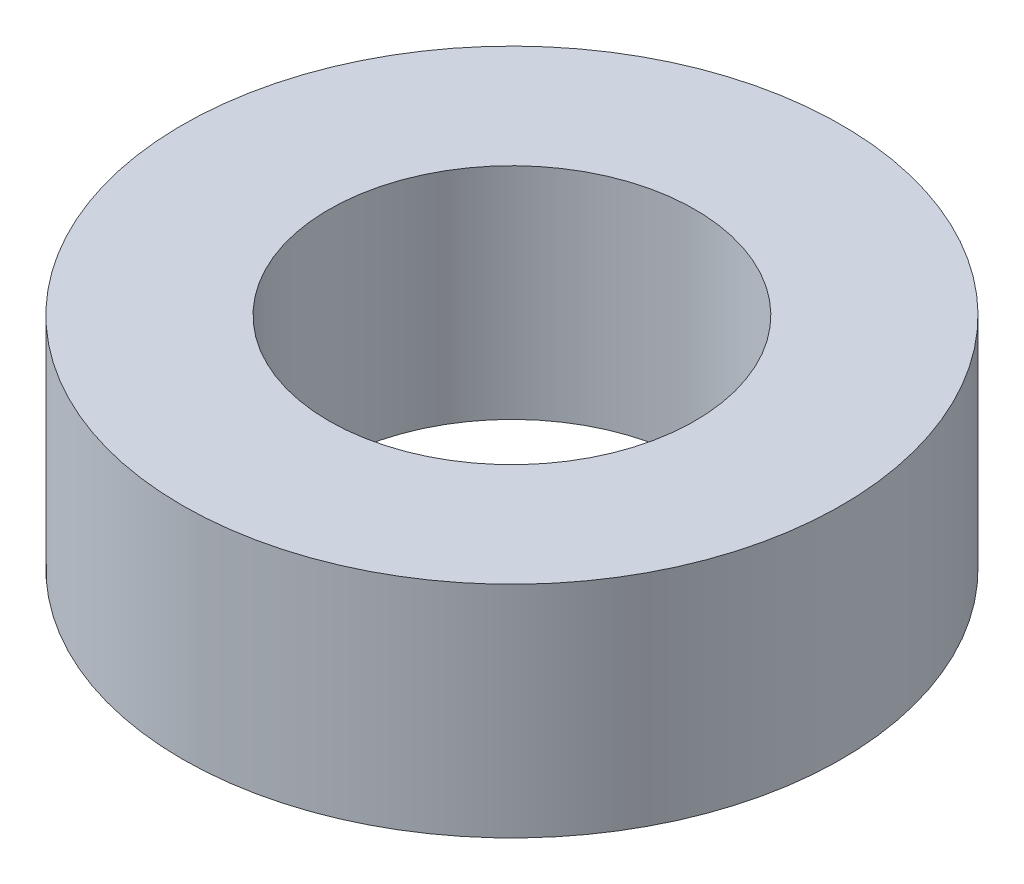
ISO-10303-21;
HEADER;
FILE_DESCRIPTION(('STEP AP214'),'2;1');
FILE_NAME('part.step','',(''),(''),'','','');
FILE_SCHEMA(('AUTOMOTIVE_DESIGN { 1 0 10303 214 1 1 1 1 }'));
ENDSEC;
DATA;
#1=APPLICATION_CONTEXT('core data for automotive mechanical design processes');
#2=APPLICATION_PROTOCOL_DEFINITION('international standard','automotive_design',2000,#1);
#3=PRODUCT_CONTEXT('',#1,'mechanical');
#4=PRODUCT('Part','Part','',(#3));
#5=PRODUCT_RELATED_PRODUCT_CATEGORY('part','',(#4));
#6=PRODUCT_DEFINITION_FORMATION('','',#4);
#7=PRODUCT_DEFINITION_CONTEXT('part definition',#1,'design');
#8=PRODUCT_DEFINITION('design','',#6,#7);
#9=PRODUCT_DEFINITION_SHAPE('','',#8);
#10=(LENGTH_UNIT() NAMED_UNIT(*) SI_UNIT(.MILLI.,.METRE.));
#11=(NAMED_UNIT(*) PLANE_ANGLE_UNIT() SI_UNIT($,.RADIAN.));
#12=(NAMED_UNIT(*) SI_UNIT($,.STERADIAN.) SOLID_ANGLE_UNIT());
#13=UNCERTAINTY_MEASURE_WITH_UNIT(LENGTH_MEASURE(1.E-05),#10,'distance_accuracy_value','');
#14=(GEOMETRIC_REPRESENTATION_CONTEXT(3) GLOBAL_UNCERTAINTY_ASSIGNED_CONTEXT((#13)) GLOBAL_UNIT_ASSIGNED_CONTEXT((#10,
#11,#12)) REPRESENTATION_CONTEXT('',''));
#15=CARTESIAN_POINT('',(0.,0.,0.));
#16=DIRECTION('',(0.,0.,1.));
#17=DIRECTION('',(1.,0.,0.));
#18=AXIS2_PLACEMENT_3D('',#15,#16,#17);
#19=CARTESIAN_POINT('',(0.,30.,0.));
#20=DIRECTION('',(0.,-1.,0.));
#21=DIRECTION('',(0.,0.,-1.));
#22=AXIS2_PLACEMENT_3D('',#19,#20,#21);
#23=CYLINDRICAL_SURFACE('',#22,45.);
#24=CARTESIAN_POINT('',(0.,30.,0.));
#25=DIRECTION('',(0.,1.,0.));
#26=DIRECTION('',(0.,0.,1.));
#27=AXIS2_PLACEMENT_3D('',#24,#25,#26);
#28=CIRCLE('',#27,45.);
#29=CARTESIAN_POINT('',(0.,30.,45.));
#30=VERTEX_POINT('',#29);
#31=EDGE_CURVE('E10',#30,#30,#28,.T.);
#32=ORIENTED_EDGE('',*,*,#31,.F.);
#33=EDGE_LOOP('',(#32));
#34=FACE_BOUND('',#33,.T.);
#35=CARTESIAN_POINT('',(0.,0.,0.));
#36=DIRECTION('',(0.,1.,0.));
#37=DIRECTION('',(0.,0.,1.));
#38=AXIS2_PLACEMENT_3D('',#35,#36,#37);
#39=CIRCLE('',#38,45.);
#40=CARTESIAN_POINT('',(0.,0.,45.));
#41=VERTEX_POINT('',#40);
#42=EDGE_CURVE('E37',#41,#41,#39,.T.);
#43=ORIENTED_EDGE('',*,*,#42,.T.);
#44=EDGE_LOOP('',(#43));
#45=FACE_BOUND('',#44,.T.);
#46=ADVANCED_FACE('F40',(#34,#45),#23,.T.);
#47=CARTESIAN_POINT('',(0.,30.,0.));
#48=DIRECTION('',(0.,1.,0.));
#49=DIRECTION('',(0.,0.,1.));
#50=AXIS2_PLACEMENT_3D('',#47,#48,#49);
#51=PLANE('',#50);
#52=CARTESIAN_POINT('',(0.,30.,0.));
#53=DIRECTION('',(0.,1.,0.));
#54=DIRECTION('',(0.,0.,1.));
#55=AXIS2_PLACEMENT_3D('',#52,#53,#54);
#56=CIRCLE('',#55,25.);
#57=CARTESIAN_POINT('',(0.,30.,25.));
#58=VERTEX_POINT('',#57);
#59=EDGE_CURVE('E50',#58,#58,#56,.T.);
#60=ORIENTED_EDGE('',*,*,#59,.F.);
#61=EDGE_LOOP('',(#60));
#62=FACE_BOUND('',#61,.T.);
#63=ORIENTED_EDGE('',*,*,#31,.T.);
#64=EDGE_LOOP('',(#63));
#65=FACE_BOUND('',#64,.T.);
#66=ADVANCED_FACE('F59',(#62,#65),#51,.T.);
#67=CARTESIAN_POINT('',(0.,0.,0.));
#68=DIRECTION('',(0.,1.,0.));
#69=DIRECTION('',(0.,0.,1.));
#70=AXIS2_PLACEMENT_3D('',#67,#68,#69);
#71=PLANE('',#70);
#72=CARTESIAN_POINT('',(0.,0.,0.));
#73=DIRECTION('',(0.,1.,0.));
#74=DIRECTION('',(0.,0.,1.));
#75=AXIS2_PLACEMENT_3D('',#72,#73,#74);
#76=CIRCLE('',#75,25.);
#77=CARTESIAN_POINT('',(0.,0.,25.));
#78=VERTEX_POINT('',#77);
#79=EDGE_CURVE('E47',#78,#78,#76,.T.);
#80=ORIENTED_EDGE('',*,*,#79,.T.);
#81=EDGE_LOOP('',(#80));
#82=FACE_BOUND('',#81,.T.);
#83=ORIENTED_EDGE('',*,*,#42,.F.);
#84=EDGE_LOOP('',(#83));
#85=FACE_BOUND('',#84,.T.);
#86=ADVANCED_FACE('F58',(#82,#85),#71,.F.);
#87=CARTESIAN_POINT('',(0.,30.,0.));
#88=DIRECTION('',(0.,-1.,0.));
#89=DIRECTION('',(0.,0.,-1.));
#90=AXIS2_PLACEMENT_3D('',#87,#88,#89);
#91=CYLINDRICAL_SURFACE('',#90,25.);
#92=ORIENTED_EDGE('',*,*,#59,.T.);
#93=EDGE_LOOP('',(#92));
#94=FACE_BOUND('',#93,.T.);
#95=ORIENTED_EDGE('',*,*,#79,.F.);
#96=EDGE_LOOP('',(#95));
#97=FACE_BOUND('',#96,.T.);
#98=ADVANCED_FACE('F54',(#94,#97),#91,.F.);
#99=CLOSED_SHELL('',(#46,#66,#86,#98));
#100=MANIFOLD_SOLID_BREP('B2',#99);
#101=ADVANCED_BREP_SHAPE_REPRESENTATION('',(#18,#100),#14);
#102=SHAPE_DEFINITION_REPRESENTATION(#9,#101);
ENDSEC;
END-ISO-10303-21;
